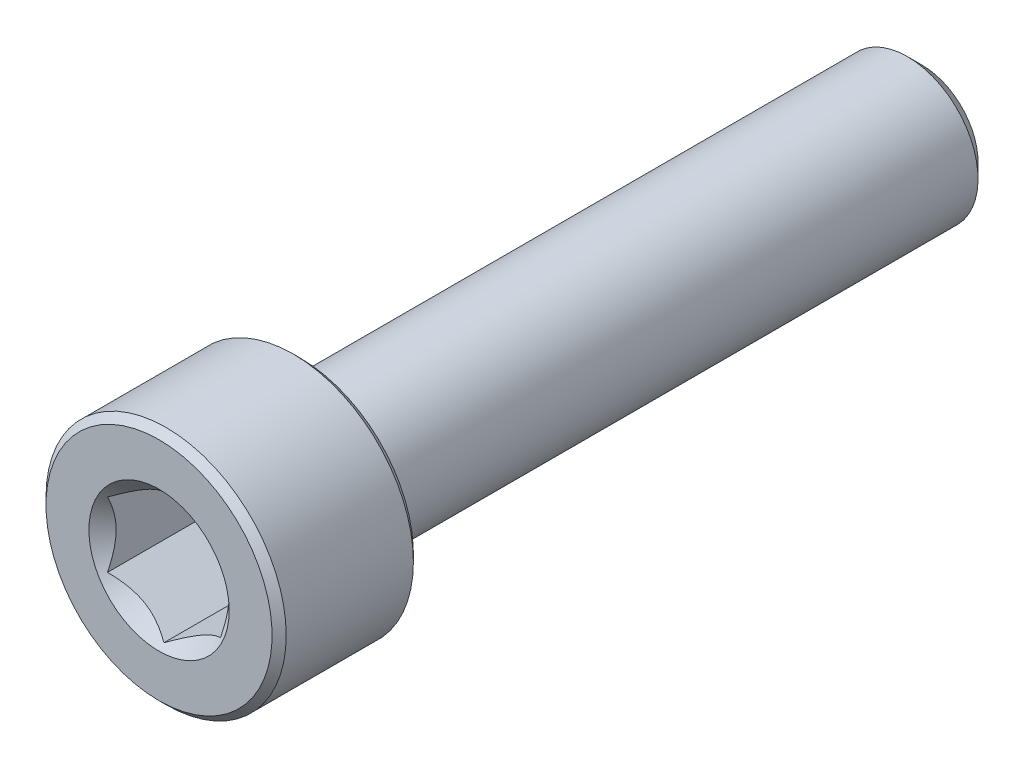
ISO-10303-21;
HEADER;
FILE_DESCRIPTION(('STEP AP214'),'2;1');
FILE_NAME('part.step','',(''),(''),'','','');
FILE_SCHEMA(('AUTOMOTIVE_DESIGN { 1 0 10303 214 1 1 1 1 }'));
ENDSEC;
DATA;
#1=APPLICATION_CONTEXT('core data for automotive mechanical design processes');
#2=APPLICATION_PROTOCOL_DEFINITION('international standard','automotive_design',2000,#1);
#3=PRODUCT_CONTEXT('',#1,'mechanical');
#4=PRODUCT('Part','Part','',(#3));
#5=PRODUCT_RELATED_PRODUCT_CATEGORY('part','',(#4));
#6=PRODUCT_DEFINITION_FORMATION('','',#4);
#7=PRODUCT_DEFINITION_CONTEXT('part definition',#1,'design');
#8=PRODUCT_DEFINITION('design','',#6,#7);
#9=PRODUCT_DEFINITION_SHAPE('','',#8);
#10=(LENGTH_UNIT() NAMED_UNIT(*) SI_UNIT(.MILLI.,.METRE.));
#11=(NAMED_UNIT(*) PLANE_ANGLE_UNIT() SI_UNIT($,.RADIAN.));
#12=(NAMED_UNIT(*) SI_UNIT($,.STERADIAN.) SOLID_ANGLE_UNIT());
#13=UNCERTAINTY_MEASURE_WITH_UNIT(LENGTH_MEASURE(1.E-05),#10,'distance_accuracy_value','');
#14=(GEOMETRIC_REPRESENTATION_CONTEXT(3) GLOBAL_UNCERTAINTY_ASSIGNED_CONTEXT((#13)) GLOBAL_UNIT_ASSIGNED_CONTEXT((#10,
#11,#12)) REPRESENTATION_CONTEXT('',''));
#15=CARTESIAN_POINT('',(0.,0.,0.));
#16=DIRECTION('',(0.,0.,1.));
#17=DIRECTION('',(1.,0.,0.));
#18=AXIS2_PLACEMENT_3D('',#15,#16,#17);
#19=CARTESIAN_POINT('',(0.,1.98038475772934,-13.5));
#20=DIRECTION('',(0.,0.,-1.));
#21=DIRECTION('',(0.,1.,0.));
#22=AXIS2_PLACEMENT_3D('',#19,#20,#21);
#23=PLANE('',#22);
#24=CARTESIAN_POINT('',(0.,0.,-13.5));
#25=DIRECTION('',(0.,0.,-1.));
#26=DIRECTION('',(0.,1.,0.));
#27=AXIS2_PLACEMENT_3D('',#24,#25,#26);
#28=CIRCLE('',#27,1.98038475772934);
#29=CARTESIAN_POINT('',(0.,1.98038475772934,-13.5));
#30=VERTEX_POINT('',#29);
#31=EDGE_CURVE('E48',#30,#30,#28,.T.);
#32=ORIENTED_EDGE('',*,*,#31,.T.);
#33=EDGE_LOOP('',(#32));
#34=FACE_BOUND('',#33,.T.);
#35=ADVANCED_FACE('F35',(#34),#23,.T.);
#36=CARTESIAN_POINT('',(0.,0.,-13.5));
#37=DIRECTION('',(0.,0.,1.));
#38=DIRECTION('',(0.,-1.,0.));
#39=AXIS2_PLACEMENT_3D('',#36,#37,#38);
#40=CONICAL_SURFACE('',#39,1.98038475772934,0.785398163397443);
#41=CARTESIAN_POINT('',(0.,0.,-12.9803847577293));
#42=DIRECTION('',(0.,0.,-1.));
#43=DIRECTION('',(0.,1.,0.));
#44=AXIS2_PLACEMENT_3D('',#41,#42,#43);
#45=CIRCLE('',#44,2.5);
#46=CARTESIAN_POINT('',(0.,2.5,-12.9803847577293));
#47=VERTEX_POINT('',#46);
#48=EDGE_CURVE('E151',#47,#47,#45,.T.);
#49=ORIENTED_EDGE('',*,*,#48,.T.);
#50=EDGE_LOOP('',(#49));
#51=FACE_BOUND('',#50,.T.);
#52=ORIENTED_EDGE('',*,*,#31,.F.);
#53=EDGE_LOOP('',(#52));
#54=FACE_BOUND('',#53,.T.);
#55=ADVANCED_FACE('F157',(#51,#54),#40,.T.);
#56=CARTESIAN_POINT('',(0.,0.,-13.5));
#57=DIRECTION('',(0.,0.,-1.));
#58=DIRECTION('',(0.,1.,0.));
#59=AXIS2_PLACEMENT_3D('',#56,#57,#58);
#60=CYLINDRICAL_SURFACE('',#59,2.5);
#61=CARTESIAN_POINT('',(0.,0.,8.25));
#62=DIRECTION('',(0.,0.,-1.));
#63=DIRECTION('',(0.,1.,0.));
#64=AXIS2_PLACEMENT_3D('',#61,#62,#63);
#65=CIRCLE('',#64,2.5);
#66=CARTESIAN_POINT('',(0.,2.5,8.25));
#67=VERTEX_POINT('',#66);
#68=EDGE_CURVE('E148',#67,#67,#65,.T.);
#69=ORIENTED_EDGE('',*,*,#68,.T.);
#70=EDGE_LOOP('',(#69));
#71=FACE_BOUND('',#70,.T.);
#72=ORIENTED_EDGE('',*,*,#48,.F.);
#73=EDGE_LOOP('',(#72));
#74=FACE_BOUND('',#73,.T.);
#75=ADVANCED_FACE('F159',(#71,#74),#60,.T.);
#76=CARTESIAN_POINT('',(0.,0.,8.25));
#77=DIRECTION('',(0.,0.,-1.));
#78=DIRECTION('',(0.,1.,0.));
#79=AXIS2_PLACEMENT_3D('',#76,#77,#78);
#80=TOROIDAL_SURFACE('',#79,2.75,0.25);
#81=CARTESIAN_POINT('',(0.,0.,8.5));
#82=DIRECTION('',(0.,0.,-1.));
#83=DIRECTION('',(0.,1.,0.));
#84=AXIS2_PLACEMENT_3D('',#81,#82,#83);
#85=CIRCLE('',#84,2.75);
#86=CARTESIAN_POINT('',(0.,2.75,8.5));
#87=VERTEX_POINT('',#86);
#88=EDGE_CURVE('E145',#87,#87,#85,.T.);
#89=ORIENTED_EDGE('',*,*,#88,.T.);
#90=EDGE_LOOP('',(#89));
#91=FACE_BOUND('',#90,.T.);
#92=ORIENTED_EDGE('',*,*,#68,.F.);
#93=EDGE_LOOP('',(#92));
#94=FACE_BOUND('',#93,.T.);
#95=ADVANCED_FACE('F165',(#91,#94),#80,.F.);
#96=CARTESIAN_POINT('',(0.,4.,8.5));
#97=DIRECTION('',(0.,0.,-1.));
#98=DIRECTION('',(0.,1.,0.));
#99=AXIS2_PLACEMENT_3D('',#96,#97,#98);
#100=PLANE('',#99);
#101=CARTESIAN_POINT('',(0.,0.,8.5));
#102=DIRECTION('',(0.,0.,-1.));
#103=DIRECTION('',(0.,1.,0.));
#104=AXIS2_PLACEMENT_3D('',#101,#102,#103);
#105=CIRCLE('',#104,4.);
#106=CARTESIAN_POINT('',(0.,4.,8.5));
#107=VERTEX_POINT('',#106);
#108=EDGE_CURVE('E142',#107,#107,#105,.T.);
#109=ORIENTED_EDGE('',*,*,#108,.T.);
#110=EDGE_LOOP('',(#109));
#111=FACE_BOUND('',#110,.T.);
#112=ORIENTED_EDGE('',*,*,#88,.F.);
#113=EDGE_LOOP('',(#112));
#114=FACE_BOUND('',#113,.T.);
#115=ADVANCED_FACE('F171',(#111,#114),#100,.T.);
#116=CARTESIAN_POINT('',(0.,0.,8.5));
#117=DIRECTION('',(0.,0.,1.));
#118=DIRECTION('',(0.,-1.,0.));
#119=AXIS2_PLACEMENT_3D('',#116,#117,#118);
#120=CONICAL_SURFACE('',#119,4.,0.785398163397448);
#121=CARTESIAN_POINT('',(0.,0.,8.75));
#122=DIRECTION('',(0.,0.,-1.));
#123=DIRECTION('',(0.,1.,0.));
#124=AXIS2_PLACEMENT_3D('',#121,#122,#123);
#125=CIRCLE('',#124,4.25);
#126=CARTESIAN_POINT('',(0.,4.25,8.75));
#127=VERTEX_POINT('',#126);
#128=EDGE_CURVE('E139',#127,#127,#125,.T.);
#129=ORIENTED_EDGE('',*,*,#128,.T.);
#130=EDGE_LOOP('',(#129));
#131=FACE_BOUND('',#130,.T.);
#132=ORIENTED_EDGE('',*,*,#108,.F.);
#133=EDGE_LOOP('',(#132));
#134=FACE_BOUND('',#133,.T.);
#135=ADVANCED_FACE('F175',(#131,#134),#120,.T.);
#136=CARTESIAN_POINT('',(0.,0.,-13.5));
#137=DIRECTION('',(0.,0.,-1.));
#138=DIRECTION('',(0.,1.,0.));
#139=AXIS2_PLACEMENT_3D('',#136,#137,#138);
#140=CYLINDRICAL_SURFACE('',#139,4.25);
#141=CARTESIAN_POINT('',(0.,0.,13.25));
#142=DIRECTION('',(0.,0.,-1.));
#143=DIRECTION('',(0.,1.,0.));
#144=AXIS2_PLACEMENT_3D('',#141,#142,#143);
#145=CIRCLE('',#144,4.25);
#146=CARTESIAN_POINT('',(0.,4.25,13.25));
#147=VERTEX_POINT('',#146);
#148=EDGE_CURVE('E136',#147,#147,#145,.T.);
#149=ORIENTED_EDGE('',*,*,#148,.T.);
#150=EDGE_LOOP('',(#149));
#151=FACE_BOUND('',#150,.T.);
#152=ORIENTED_EDGE('',*,*,#128,.F.);
#153=EDGE_LOOP('',(#152));
#154=FACE_BOUND('',#153,.T.);
#155=ADVANCED_FACE('F179',(#151,#154),#140,.T.);
#156=CARTESIAN_POINT('',(0.,0.,13.25));
#157=DIRECTION('',(0.,0.,-1.));
#158=DIRECTION('',(0.,1.,0.));
#159=AXIS2_PLACEMENT_3D('',#156,#157,#158);
#160=CONICAL_SURFACE('',#159,4.25,0.785398163397448);
#161=CARTESIAN_POINT('',(0.,0.,13.5));
#162=DIRECTION('',(0.,0.,-1.));
#163=DIRECTION('',(0.,1.,0.));
#164=AXIS2_PLACEMENT_3D('',#161,#162,#163);
#165=CIRCLE('',#164,4.);
#166=CARTESIAN_POINT('',(0.,4.,13.5));
#167=VERTEX_POINT('',#166);
#168=EDGE_CURVE('E133',#167,#167,#165,.T.);
#169=ORIENTED_EDGE('',*,*,#168,.T.);
#170=EDGE_LOOP('',(#169));
#171=FACE_BOUND('',#170,.T.);
#172=ORIENTED_EDGE('',*,*,#148,.F.);
#173=EDGE_LOOP('',(#172));
#174=FACE_BOUND('',#173,.T.);
#175=ADVANCED_FACE('F183',(#171,#174),#160,.T.);
#176=CARTESIAN_POINT('',(0.,0.,13.5));
#177=DIRECTION('',(0.,0.,1.));
#178=DIRECTION('',(0.,-1.,0.));
#179=AXIS2_PLACEMENT_3D('',#176,#177,#178);
#180=PLANE('',#179);
#181=CARTESIAN_POINT('',(0.,0.,13.5));
#182=DIRECTION('',(0.,0.,1.));
#183=DIRECTION('',(1.,0.,0.));
#184=AXIS2_PLACEMENT_3D('',#181,#182,#183);
#185=CIRCLE('',#184,2.48260615751539);
#186=CARTESIAN_POINT('',(2.48260615751539,0.,13.5));
#187=VERTEX_POINT('',#186);
#188=EDGE_CURVE('E107',#187,#187,#185,.T.);
#189=ORIENTED_EDGE('',*,*,#188,.F.);
#190=EDGE_LOOP('',(#189));
#191=FACE_BOUND('',#190,.T.);
#192=ORIENTED_EDGE('',*,*,#168,.F.);
#193=EDGE_LOOP('',(#192));
#194=FACE_BOUND('',#193,.T.);
#195=ADVANCED_FACE('F187',(#191,#194),#180,.T.);
#196=CARTESIAN_POINT('',(0.,0.,13.5));
#197=DIRECTION('',(0.,0.,1.));
#198=DIRECTION('',(1.,0.,0.));
#199=AXIS2_PLACEMENT_3D('',#196,#197,#198);
#200=CONICAL_SURFACE('',#199,2.48260615751539,0.78539816339745);
#201=ORIENTED_EDGE('',*,*,#188,.T.);
#202=EDGE_LOOP('',(#201));
#203=FACE_BOUND('',#202,.T.);
#204=CARTESIAN_POINT('',(-0.000199999999998729,-2.30951654681234,13.3269103979568));
#205=CARTESIAN_POINT('',(0.0685530340307069,-2.26982196410711,13.2872480094687));
#206=CARTESIAN_POINT('',(0.138455742135513,-2.22946361676572,13.2499149015273));
#207=CARTESIAN_POINT('',(0.280995244550438,-2.1471683966763,13.1815586043793));
#208=CARTESIAN_POINT('',(0.35364559756536,-2.10522369580642,13.1505734529803));
#209=CARTESIAN_POINT('',(0.500141601053972,-2.02064418875706,13.0974951357873));
#210=CARTESIAN_POINT('',(0.573949935246295,-1.97803092714269,13.0752685464197));
#211=CARTESIAN_POINT('',(0.723191631835265,-1.89186619344273,13.0410237359182));
#212=CARTESIAN_POINT('',(0.798620433918153,-1.84831735425552,13.0289799483872));
#213=CARTESIAN_POINT('',(0.928615500671081,-1.7732646674724,13.0181134311487));
#214=CARTESIAN_POINT('',(0.98301378397011,-1.74185780396625,13.0165046728531));
#215=CARTESIAN_POINT('',(1.0917214555197,-1.67909540053412,13.0192137968418));
#216=CARTESIAN_POINT('',(1.14603080592134,-1.64773988246021,13.0235337570011));
#217=CARTESIAN_POINT('',(1.25413672758934,-1.5853248994842,13.037854486653));
#218=CARTESIAN_POINT('',(1.30793265655479,-1.55426580541469,13.0478616120051));
#219=CARTESIAN_POINT('',(1.41459426230557,-1.49268469862228,13.0730073494928));
#220=CARTESIAN_POINT('',(1.46746001007071,-1.46216264491917,13.0881455682854));
#221=CARTESIAN_POINT('',(1.60287973308985,-1.38397803138049,13.1330894226723));
#222=CARTESIAN_POINT('',(1.68459383484948,-1.33680037273297,13.1662837586689));
#223=CARTESIAN_POINT('',(1.8047470372578,-1.26742988897853,13.2223207424145));
#224=CARTESIAN_POINT('',(1.84434285210918,-1.24456923461531,13.2420096221901));
#225=CARTESIAN_POINT('',(1.92280095888787,-1.19927142554652,13.283182237608));
#226=CARTESIAN_POINT('',(1.96166368359374,-1.17683402097614,13.3046648708944));
#227=CARTESIAN_POINT('',(2.0002,-1.15458506832541,13.3269103979568));
#228=B_SPLINE_CURVE_WITH_KNOTS('',3,(#204,#205,#206,#207,#208,#209,#210,#211,#212,#213,#214,
#215,#216,#217,#218,#219,#220,#221,#222,#223,#224,#225,#226,#227),.UNSPECIFIED.,.F.,.F.,(4,2,2,
2,2,2,2,2,2,2,2,4),(0.,0.266420613771064,0.534393751523388,0.798110374376914,1.06116288956936,
1.24939906803722,1.43770123566248,1.62621426093932,1.81471283831913,2.11415604834145,
2.2634717071779,2.41269626969771),.UNSPECIFIED.);
#229=CARTESIAN_POINT('',(0.,-2.3094010767585,13.3267949192431));
#230=VERTEX_POINT('',#229);
#231=CARTESIAN_POINT('',(2.,-1.15470053837925,13.3267949192431));
#232=VERTEX_POINT('',#231);
#233=EDGE_CURVE('E12',#230,#232,#228,.T.);
#234=ORIENTED_EDGE('',*,*,#233,.F.);
#235=CARTESIAN_POINT('',(-2.0002,-1.15458506832541,13.3269103979568));
#236=CARTESIAN_POINT('',(-1.93144696596929,-1.19427965103064,13.2872480094687));
#237=CARTESIAN_POINT('',(-1.86154425786449,-1.23463799837204,13.2499149015273));
#238=CARTESIAN_POINT('',(-1.71900475544956,-1.31693321846145,13.1815586043793));
#239=CARTESIAN_POINT('',(-1.64635440243464,-1.35887791933134,13.1505734529803));
#240=CARTESIAN_POINT('',(-1.49985839894603,-1.44345742638069,13.0974951357873));
#241=CARTESIAN_POINT('',(-1.42605006475371,-1.48607068799507,13.0752685464197));
#242=CARTESIAN_POINT('',(-1.27680836816474,-1.57223542169503,13.0410237359182));
#243=CARTESIAN_POINT('',(-1.20137956608185,-1.61578426088223,13.0289799483872));
#244=CARTESIAN_POINT('',(-1.07138449932892,-1.69083694766536,13.0181134311487));
#245=CARTESIAN_POINT('',(-1.01698621602989,-1.72224381117151,13.0165046728531));
#246=CARTESIAN_POINT('',(-0.908278544480305,-1.78500621460364,13.0192137968418));
#247=CARTESIAN_POINT('',(-0.85396919407866,-1.81636173267754,13.0235337570011));
#248=CARTESIAN_POINT('',(-0.745863272410661,-1.87877671565355,13.037854486653));
#249=CARTESIAN_POINT('',(-0.692067343445206,-1.90983580972306,13.0478616120051));
#250=CARTESIAN_POINT('',(-0.585405737694425,-1.97141691651548,13.0730073494928));
#251=CARTESIAN_POINT('',(-0.532539989929286,-2.00193897021859,13.0881455682854));
#252=CARTESIAN_POINT('',(-0.397120266910154,-2.08012358375727,13.1330894226723));
#253=CARTESIAN_POINT('',(-0.31540616515052,-2.12730124240478,13.1662837586689));
#254=CARTESIAN_POINT('',(-0.195252962742196,-2.19667172615922,13.2223207424145));
#255=CARTESIAN_POINT('',(-0.155657147890821,-2.21953238052245,13.2420096221901));
#256=CARTESIAN_POINT('',(-0.0771990411121259,-2.26483018959124,13.283182237608));
#257=CARTESIAN_POINT('',(-0.0383363164062579,-2.28726759416161,13.3046648708944));
#258=CARTESIAN_POINT('',(0.00020000000000141,-2.30951654681234,13.3269103979568));
#259=B_SPLINE_CURVE_WITH_KNOTS('',3,(#235,#236,#237,#238,#239,#240,#241,#242,#243,#244,#245,
#246,#247,#248,#249,#250,#251,#252,#253,#254,#255,#256,#257,#258),.UNSPECIFIED.,.F.,.F.,(4,2,2,
2,2,2,2,2,2,2,2,4),(0.,0.266420613771064,0.53439375152339,0.798110374376915,1.06116288956937,
1.24939906803722,1.43770123566248,1.62621426093932,1.81471283831913,2.11415604834145,
2.26347170717791,2.41269626969771),.UNSPECIFIED.);
#260=CARTESIAN_POINT('',(-2.,-1.15470053837925,13.3267949192431));
#261=VERTEX_POINT('',#260);
#262=EDGE_CURVE('E93',#261,#230,#259,.T.);
#263=ORIENTED_EDGE('',*,*,#262,.F.);
#264=CARTESIAN_POINT('',(-2.,-2.42398175579868,14.1599545105457));
#265=CARTESIAN_POINT('',(-2.,-2.36547387630411,14.1148351758713));
#266=CARTESIAN_POINT('',(-2.,-2.30665236661135,14.0701161756265));
#267=CARTESIAN_POINT('',(-2.,-2.18825331969085,13.9816622121418));
#268=CARTESIAN_POINT('',(-2.,-2.12867560822125,13.9379274823771));
#269=CARTESIAN_POINT('',(-2.,-2.00820019262835,13.8513142462896));
#270=CARTESIAN_POINT('',(-2.,-1.94729585350119,13.8084449389484));
#271=CARTESIAN_POINT('',(-2.,-1.82447635639412,13.7241846501668));
#272=CARTESIAN_POINT('',(-2.,-1.76256126823391,13.6827935672392));
#273=CARTESIAN_POINT('',(-2.,-1.63352305153315,13.5992199648467));
#274=CARTESIAN_POINT('',(-2.,-1.56632133333278,13.5571581799355));
#275=CARTESIAN_POINT('',(-2.,-1.43035896394453,13.4756383889365));
#276=CARTESIAN_POINT('',(-2.,-1.3615985170145,13.4361800443101));
#277=CARTESIAN_POINT('',(-2.,-1.22246684398892,13.3606863637627));
#278=CARTESIAN_POINT('',(-2.,-1.15210085009344,13.3246414605251));
#279=CARTESIAN_POINT('',(-2.,-1.00937086384546,13.2567889383446));
#280=CARTESIAN_POINT('',(-2.,-0.937007838648202,13.224979310286));
#281=CARTESIAN_POINT('',(-2.,-0.797532850709096,13.1696918996687));
#282=CARTESIAN_POINT('',(-2.,-0.73062786798457,13.1456972616385));
#283=CARTESIAN_POINT('',(-2.,-0.595101218410189,13.1030621374066));
#284=CARTESIAN_POINT('',(-2.,-0.526479443554564,13.0844219889886));
#285=CARTESIAN_POINT('',(-2.,-0.389131528451131,13.0538205255166));
#286=CARTESIAN_POINT('',(-2.,-0.320433088583213,13.0417369815865));
#287=CARTESIAN_POINT('',(-2.,-0.182167175628636,13.0245029259217));
#288=CARTESIAN_POINT('',(-2.,-0.112599890436882,13.0193509405131));
#289=CARTESIAN_POINT('',(-2.,0.0235742388197043,13.0164261236486));
#290=CARTESIAN_POINT('',(-2.,0.090174262254322,13.0183334186349));
#291=CARTESIAN_POINT('',(-2.,0.222860647279179,13.0286844259992));
#292=CARTESIAN_POINT('',(-2.,0.288946962142557,13.037128726115));
#293=CARTESIAN_POINT('',(-2.,0.421249515605842,13.0602169544548));
#294=CARTESIAN_POINT('',(-2.,0.487446247340619,13.074970869731));
#295=CARTESIAN_POINT('',(-2.,0.618375539180381,13.1098579982816));
#296=CARTESIAN_POINT('',(-2.,0.683108176846779,13.1299909258717));
#297=CARTESIAN_POINT('',(-2.,0.881750195572363,13.199485149858));
#298=CARTESIAN_POINT('',(-2.,1.01295821830486,13.2565400033525));
#299=CARTESIAN_POINT('',(-2.,1.26925973679032,13.3835183967961));
#300=CARTESIAN_POINT('',(-2.,1.39432972284545,13.4534871660011));
#301=CARTESIAN_POINT('',(-2.,1.57512870977373,13.5627644548654));
#302=CARTESIAN_POINT('',(-2.,1.63281357796872,13.5989012241787));
#303=CARTESIAN_POINT('',(-2.,1.74719269140407,13.6727216099303));
#304=CARTESIAN_POINT('',(-2.,1.80388686201493,13.7104053421917));
#305=CARTESIAN_POINT('',(-2.,1.91595826038669,13.7867305219709));
#306=CARTESIAN_POINT('',(-2.,1.97134240267412,13.8253618677048));
#307=CARTESIAN_POINT('',(-2.,2.08135060816028,13.9036615543687));
#308=CARTESIAN_POINT('',(-2.,2.13597487670731,13.9433296064566));
#309=CARTESIAN_POINT('',(-2.,2.19028039622782,13.9834228737147));
#310=B_SPLINE_CURVE_WITH_KNOTS('',3,(#264,#265,#266,#267,#268,#269,#270,#271,#272,#273,#274,
#275,#276,#277,#278,#279,#280,#281,#282,#283,#284,#285,#286,#287,#288,#289,#290,#291,#292,#293,
#294,#295,#296,#297,#298,#299,#300,#301,#302,#303,#304,#305,#306,#307,#308,#309),.UNSPECIFIED.,
.F.,.F.,(4,2,2,2,2,2,2,2,2,2,2,2,2,2,2,2,2,2,2,2,2,2,4),(0.,0.22165766710034,0.443367370127324,
0.666786125723388,0.890189512941441,1.12798201434515,1.36574353320624,1.60281759521649,
1.83977879106023,2.05282811904838,2.26589088413717,2.47483185958037,2.68372840641278,
2.88327763021218,3.08284479743513,3.28604242448891,3.48922926167214,3.91721633282416,
4.34673183999753,4.55091998635569,4.75512344852471,4.95768958131487,5.1601998654356),.UNSPECIFIED.);
#311=CARTESIAN_POINT('',(-2.,1.15470053837925,13.3267949192431));
#312=VERTEX_POINT('',#311);
#313=EDGE_CURVE('E106',#312,#261,#310,.F.);
#314=ORIENTED_EDGE('',*,*,#313,.F.);
#315=CARTESIAN_POINT('',(0.000199999999999905,2.30951654681234,13.3269103979568));
#316=CARTESIAN_POINT('',(-0.068553034030706,2.26982196410711,13.2872480094687));
#317=CARTESIAN_POINT('',(-0.138455742135512,2.22946361676572,13.2499149015273));
#318=CARTESIAN_POINT('',(-0.280995244550437,2.1471683966763,13.1815586043793));
#319=CARTESIAN_POINT('',(-0.353645597565359,2.10522369580642,13.1505734529803));
#320=CARTESIAN_POINT('',(-0.500141601053972,2.02064418875706,13.0974951357873));
#321=CARTESIAN_POINT('',(-0.573949935246295,1.97803092714269,13.0752685464197));
#322=CARTESIAN_POINT('',(-0.723191631835265,1.89186619344273,13.0410237359182));
#323=CARTESIAN_POINT('',(-0.798620433918153,1.84831735425552,13.0289799483872));
#324=CARTESIAN_POINT('',(-0.92861550067108,1.7732646674724,13.0181134311487));
#325=CARTESIAN_POINT('',(-0.98301378397011,1.74185780396625,13.0165046728531));
#326=CARTESIAN_POINT('',(-1.09172145551969,1.67909540053412,13.0192137968418));
#327=CARTESIAN_POINT('',(-1.14603080592134,1.64773988246021,13.0235337570011));
#328=CARTESIAN_POINT('',(-1.25413672758934,1.5853248994842,13.037854486653));
#329=CARTESIAN_POINT('',(-1.30793265655479,1.55426580541469,13.0478616120051));
#330=CARTESIAN_POINT('',(-1.41459426230557,1.49268469862228,13.0730073494928));
#331=CARTESIAN_POINT('',(-1.46746001007071,1.46216264491916,13.0881455682854));
#332=CARTESIAN_POINT('',(-1.60287973308984,1.38397803138048,13.1330894226723));
#333=CARTESIAN_POINT('',(-1.68459383484948,1.33680037273297,13.1662837586689));
#334=CARTESIAN_POINT('',(-1.8047470372578,1.26742988897853,13.2223207424145));
#335=CARTESIAN_POINT('',(-1.84434285210918,1.24456923461531,13.2420096221901));
#336=CARTESIAN_POINT('',(-1.92280095888787,1.19927142554652,13.283182237608));
#337=CARTESIAN_POINT('',(-1.96166368359374,1.17683402097614,13.3046648708944));
#338=CARTESIAN_POINT('',(-2.0002,1.15458506832541,13.3269103979568));
#339=B_SPLINE_CURVE_WITH_KNOTS('',3,(#315,#316,#317,#318,#319,#320,#321,#322,#323,#324,#325,
#326,#327,#328,#329,#330,#331,#332,#333,#334,#335,#336,#337,#338),.UNSPECIFIED.,.F.,.F.,(4,2,2,
2,2,2,2,2,2,2,2,4),(0.,0.266420613771063,0.534393751523389,0.798110374376915,1.06116288956937,
1.24939906803722,1.43770123566248,1.62621426093932,1.81471283831913,2.11415604834145,
2.2634717071779,2.41269626969771),.UNSPECIFIED.);
#340=CARTESIAN_POINT('',(0.,2.3094010767585,13.3267949192431));
#341=VERTEX_POINT('',#340);
#342=EDGE_CURVE('E237',#341,#312,#339,.T.);
#343=ORIENTED_EDGE('',*,*,#342,.F.);
#344=CARTESIAN_POINT('',(2.0002,1.15458506832541,13.3269103979568));
#345=CARTESIAN_POINT('',(1.93144696596929,1.19427965103064,13.2872480094687));
#346=CARTESIAN_POINT('',(1.86154425786449,1.23463799837204,13.2499149015273));
#347=CARTESIAN_POINT('',(1.71900475544956,1.31693321846145,13.1815586043793));
#348=CARTESIAN_POINT('',(1.64635440243464,1.35887791933134,13.1505734529803));
#349=CARTESIAN_POINT('',(1.49985839894603,1.44345742638069,13.0974951357873));
#350=CARTESIAN_POINT('',(1.42605006475371,1.48607068799507,13.0752685464197));
#351=CARTESIAN_POINT('',(1.27680836816474,1.57223542169503,13.0410237359182));
#352=CARTESIAN_POINT('',(1.20137956608185,1.61578426088223,13.0289799483872));
#353=CARTESIAN_POINT('',(1.07138449932892,1.69083694766536,13.0181134311487));
#354=CARTESIAN_POINT('',(1.01698621602989,1.72224381117151,13.0165046728531));
#355=CARTESIAN_POINT('',(0.908278544480305,1.78500621460364,13.0192137968418));
#356=CARTESIAN_POINT('',(0.85396919407866,1.81636173267754,13.0235337570011));
#357=CARTESIAN_POINT('',(0.745863272410661,1.87877671565355,13.037854486653));
#358=CARTESIAN_POINT('',(0.692067343445207,1.90983580972306,13.0478616120051));
#359=CARTESIAN_POINT('',(0.585405737694425,1.97141691651547,13.0730073494928));
#360=CARTESIAN_POINT('',(0.532539989929286,2.00193897021859,13.0881455682854));
#361=CARTESIAN_POINT('',(0.397120266910155,2.08012358375727,13.1330894226723));
#362=CARTESIAN_POINT('',(0.315406165150521,2.12730124240478,13.1662837586689));
#363=CARTESIAN_POINT('',(0.195252962742197,2.19667172615922,13.2223207424145));
#364=CARTESIAN_POINT('',(0.155657147890823,2.21953238052245,13.2420096221901));
#365=CARTESIAN_POINT('',(0.0771990411121273,2.26483018959124,13.283182237608));
#366=CARTESIAN_POINT('',(0.0383363164062591,2.28726759416161,13.3046648708944));
#367=CARTESIAN_POINT('',(-0.000200000000000571,2.30951654681234,13.3269103979568));
#368=B_SPLINE_CURVE_WITH_KNOTS('',3,(#344,#345,#346,#347,#348,#349,#350,#351,#352,#353,#354,
#355,#356,#357,#358,#359,#360,#361,#362,#363,#364,#365,#366,#367),.UNSPECIFIED.,.F.,.F.,(4,2,2,
2,2,2,2,2,2,2,2,4),(0.,0.266420613771064,0.534393751523388,0.798110374376915,1.06116288956936,
1.24939906803722,1.43770123566248,1.62621426093932,1.81471283831913,2.11415604834145,
2.26347170717791,2.41269626969771),.UNSPECIFIED.);
#369=CARTESIAN_POINT('',(2.,1.15470053837925,13.3267949192431));
#370=VERTEX_POINT('',#369);
#371=EDGE_CURVE('E210',#370,#341,#368,.T.);
#372=ORIENTED_EDGE('',*,*,#371,.F.);
#373=CARTESIAN_POINT('',(2.,-2.42398175579868,14.1599545105457));
#374=CARTESIAN_POINT('',(2.,-2.3654738763041,14.1148351758713));
#375=CARTESIAN_POINT('',(2.,-2.30665236661135,14.0701161756265));
#376=CARTESIAN_POINT('',(2.,-2.18825331969085,13.9816622121418));
#377=CARTESIAN_POINT('',(2.,-2.12867560822125,13.9379274823771));
#378=CARTESIAN_POINT('',(2.,-2.00820019262835,13.8513142462896));
#379=CARTESIAN_POINT('',(2.,-1.94729585350119,13.8084449389484));
#380=CARTESIAN_POINT('',(2.,-1.82447635639412,13.7241846501668));
#381=CARTESIAN_POINT('',(2.,-1.76256126823391,13.6827935672392));
#382=CARTESIAN_POINT('',(2.,-1.63352305153315,13.5992199648467));
#383=CARTESIAN_POINT('',(2.,-1.56632133333278,13.5571581799355));
#384=CARTESIAN_POINT('',(2.,-1.43035896394453,13.4756383889365));
#385=CARTESIAN_POINT('',(2.,-1.3615985170145,13.4361800443101));
#386=CARTESIAN_POINT('',(2.,-1.22246684398892,13.3606863637627));
#387=CARTESIAN_POINT('',(2.,-1.15210085009344,13.3246414605251));
#388=CARTESIAN_POINT('',(2.,-1.00937086384545,13.2567889383446));
#389=CARTESIAN_POINT('',(2.,-0.937007838648201,13.224979310286));
#390=CARTESIAN_POINT('',(2.,-0.797532850709095,13.1696918996687));
#391=CARTESIAN_POINT('',(2.,-0.730627867984569,13.1456972616385));
#392=CARTESIAN_POINT('',(2.,-0.595101218410188,13.1030621374066));
#393=CARTESIAN_POINT('',(2.,-0.526479443554564,13.0844219889886));
#394=CARTESIAN_POINT('',(2.,-0.389131528451131,13.0538205255166));
#395=CARTESIAN_POINT('',(2.,-0.320433088583214,13.0417369815865));
#396=CARTESIAN_POINT('',(2.,-0.182167175628637,13.0245029259217));
#397=CARTESIAN_POINT('',(2.,-0.112599890436883,13.0193509405131));
#398=CARTESIAN_POINT('',(2.,0.0235742388197037,13.0164261236486));
#399=CARTESIAN_POINT('',(2.,0.0901742622543216,13.0183334186349));
#400=CARTESIAN_POINT('',(2.,0.222860647279179,13.0286844259992));
#401=CARTESIAN_POINT('',(2.,0.288946962142556,13.037128726115));
#402=CARTESIAN_POINT('',(2.,0.421249515605842,13.0602169544548));
#403=CARTESIAN_POINT('',(2.,0.487446247340619,13.074970869731));
#404=CARTESIAN_POINT('',(2.,0.61837553918038,13.1098579982816));
#405=CARTESIAN_POINT('',(2.,0.683108176846778,13.1299909258717));
#406=CARTESIAN_POINT('',(2.,0.881750195572362,13.199485149858));
#407=CARTESIAN_POINT('',(2.,1.01295821830486,13.2565400033525));
#408=CARTESIAN_POINT('',(2.,1.26925973679032,13.3835183967961));
#409=CARTESIAN_POINT('',(2.,1.39432972284545,13.4534871660011));
#410=CARTESIAN_POINT('',(2.,1.57512870977373,13.5627644548654));
#411=CARTESIAN_POINT('',(2.,1.63281357796872,13.5989012241787));
#412=CARTESIAN_POINT('',(2.,1.74719269140407,13.6727216099303));
#413=CARTESIAN_POINT('',(2.,1.80388686201493,13.7104053421917));
#414=CARTESIAN_POINT('',(2.,1.91595826038669,13.7867305219709));
#415=CARTESIAN_POINT('',(2.,1.97134240267412,13.8253618677048));
#416=CARTESIAN_POINT('',(2.,2.08135060816028,13.9036615543687));
#417=CARTESIAN_POINT('',(2.,2.13597487670731,13.9433296064566));
#418=CARTESIAN_POINT('',(2.,2.19028039622781,13.9834228737147));
#419=B_SPLINE_CURVE_WITH_KNOTS('',3,(#373,#374,#375,#376,#377,#378,#379,#380,#381,#382,#383,
#384,#385,#386,#387,#388,#389,#390,#391,#392,#393,#394,#395,#396,#397,#398,#399,#400,#401,#402,
#403,#404,#405,#406,#407,#408,#409,#410,#411,#412,#413,#414,#415,#416,#417,#418),.UNSPECIFIED.,
.F.,.F.,(4,2,2,2,2,2,2,2,2,2,2,2,2,2,2,2,2,2,2,2,2,2,4),(0.,0.221657667100339,0.443367370127324,
0.666786125723386,0.89018951294144,1.12798201434515,1.36574353320624,1.60281759521649,
1.83977879106023,2.05282811904838,2.26589088413717,2.47483185958037,2.68372840641278,
2.88327763021218,3.08284479743513,3.28604242448891,3.48922926167214,3.91721633282416,
4.34673183999753,4.55091998635569,4.75512344852471,4.95768958131487,5.1601998654356),.UNSPECIFIED.);
#420=EDGE_CURVE('E55',#232,#370,#419,.T.);
#421=ORIENTED_EDGE('',*,*,#420,.F.);
#422=EDGE_LOOP('',(#234,#263,#314,#343,#372,#421));
#423=FACE_BOUND('',#422,.T.);
#424=ADVANCED_FACE('F92',(#203,#423),#200,.F.);
#425=CARTESIAN_POINT('',(0.,4.,9.5));
#426=DIRECTION('',(0.,0.,-1.));
#427=DIRECTION('',(0.,1.,0.));
#428=AXIS2_PLACEMENT_3D('',#425,#426,#427);
#429=PLANE('',#428);
#430=DIRECTION('',(0.866025403784438,0.5,0.));
#431=VECTOR('',#430,1.);
#432=CARTESIAN_POINT('',(0.,-2.3094010767585,9.5));
#433=LINE('',#432,#431);
#434=CARTESIAN_POINT('',(0.,-2.3094010767585,9.5));
#435=VERTEX_POINT('',#434);
#436=CARTESIAN_POINT('',(2.,-1.15470053837925,9.5));
#437=VERTEX_POINT('',#436);
#438=EDGE_CURVE('E110',#435,#437,#433,.T.);
#439=ORIENTED_EDGE('',*,*,#438,.T.);
#440=DIRECTION('',(0.,1.,0.));
#441=VECTOR('',#440,1.);
#442=CARTESIAN_POINT('',(2.,-1.15470053837925,9.5));
#443=LINE('',#442,#441);
#444=CARTESIAN_POINT('',(2.,1.15470053837925,9.5));
#445=VERTEX_POINT('',#444);
#446=EDGE_CURVE('E62',#437,#445,#443,.T.);
#447=ORIENTED_EDGE('',*,*,#446,.T.);
#448=DIRECTION('',(-0.866025403784439,0.5,0.));
#449=VECTOR('',#448,1.);
#450=CARTESIAN_POINT('',(2.,1.15470053837925,9.5));
#451=LINE('',#450,#449);
#452=CARTESIAN_POINT('',(0.,2.3094010767585,9.5));
#453=VERTEX_POINT('',#452);
#454=EDGE_CURVE('E118',#445,#453,#451,.T.);
#455=ORIENTED_EDGE('',*,*,#454,.T.);
#456=DIRECTION('',(-0.866025403784439,-0.5,0.));
#457=VECTOR('',#456,1.);
#458=CARTESIAN_POINT('',(0.,2.3094010767585,9.5));
#459=LINE('',#458,#457);
#460=CARTESIAN_POINT('',(-2.,1.15470053837925,9.5));
#461=VERTEX_POINT('',#460);
#462=EDGE_CURVE('E125',#453,#461,#459,.T.);
#463=ORIENTED_EDGE('',*,*,#462,.T.);
#464=DIRECTION('',(0.,-1.,0.));
#465=VECTOR('',#464,1.);
#466=CARTESIAN_POINT('',(-2.,1.15470053837925,9.5));
#467=LINE('',#466,#465);
#468=CARTESIAN_POINT('',(-2.,-1.15470053837925,9.5));
#469=VERTEX_POINT('',#468);
#470=EDGE_CURVE('E121',#461,#469,#467,.T.);
#471=ORIENTED_EDGE('',*,*,#470,.T.);
#472=DIRECTION('',(0.866025403784439,-0.5,0.));
#473=VECTOR('',#472,1.);
#474=CARTESIAN_POINT('',(-2.,-1.15470053837925,9.5));
#475=LINE('',#474,#473);
#476=EDGE_CURVE('E111',#469,#435,#475,.T.);
#477=ORIENTED_EDGE('',*,*,#476,.T.);
#478=EDGE_LOOP('',(#439,#447,#455,#463,#471,#477));
#479=FACE_BOUND('',#478,.T.);
#480=ADVANCED_FACE('F192',(#479),#429,.F.);
#481=CARTESIAN_POINT('',(0.,-2.3094010767585,2.38989907339222));
#482=DIRECTION('',(0.5,-0.866025403784438,0.));
#483=DIRECTION('',(0.866025403784438,0.5,0.));
#484=AXIS2_PLACEMENT_3D('',#481,#482,#483);
#485=PLANE('',#484);
#486=DIRECTION('',(0.,0.,1.));
#487=VECTOR('',#486,1.);
#488=CARTESIAN_POINT('',(0.,-2.3094010767585,2.38989907339222));
#489=LINE('',#488,#487);
#490=EDGE_CURVE('E102',#435,#230,#489,.T.);
#491=ORIENTED_EDGE('',*,*,#490,.T.);
#492=ORIENTED_EDGE('',*,*,#233,.T.);
#493=DIRECTION('',(0.,0.,1.));
#494=VECTOR('',#493,1.);
#495=CARTESIAN_POINT('',(2.,-1.15470053837925,2.38989907339222));
#496=LINE('',#495,#494);
#497=EDGE_CURVE('E113',#437,#232,#496,.T.);
#498=ORIENTED_EDGE('',*,*,#497,.F.);
#499=ORIENTED_EDGE('',*,*,#438,.F.);
#500=EDGE_LOOP('',(#491,#492,#498,#499));
#501=FACE_BOUND('',#500,.T.);
#502=ADVANCED_FACE('F109',(#501),#485,.F.);
#503=CARTESIAN_POINT('',(-2.,-1.15470053837925,2.38989907339222));
#504=DIRECTION('',(-0.5,-0.866025403784439,0.));
#505=DIRECTION('',(0.866025403784439,-0.5,0.));
#506=AXIS2_PLACEMENT_3D('',#503,#504,#505);
#507=PLANE('',#506);
#508=DIRECTION('',(0.,0.,1.));
#509=VECTOR('',#508,1.);
#510=CARTESIAN_POINT('',(-2.,-1.15470053837925,2.38989907339222));
#511=LINE('',#510,#509);
#512=EDGE_CURVE('E105',#469,#261,#511,.T.);
#513=ORIENTED_EDGE('',*,*,#512,.T.);
#514=ORIENTED_EDGE('',*,*,#262,.T.);
#515=ORIENTED_EDGE('',*,*,#490,.F.);
#516=ORIENTED_EDGE('',*,*,#476,.F.);
#517=EDGE_LOOP('',(#513,#514,#515,#516));
#518=FACE_BOUND('',#517,.T.);
#519=ADVANCED_FACE('F101',(#518),#507,.F.);
#520=CARTESIAN_POINT('',(-2.,1.15470053837925,2.38989907339222));
#521=DIRECTION('',(-1.,0.,0.));
#522=DIRECTION('',(0.,0.,1.));
#523=AXIS2_PLACEMENT_3D('',#520,#521,#522);
#524=PLANE('',#523);
#525=DIRECTION('',(0.,0.,1.));
#526=VECTOR('',#525,1.);
#527=CARTESIAN_POINT('',(-2.,1.15470053837925,2.38989907339222));
#528=LINE('',#527,#526);
#529=EDGE_CURVE('E122',#461,#312,#528,.T.);
#530=ORIENTED_EDGE('',*,*,#529,.T.);
#531=ORIENTED_EDGE('',*,*,#313,.T.);
#532=ORIENTED_EDGE('',*,*,#512,.F.);
#533=ORIENTED_EDGE('',*,*,#470,.F.);
#534=EDGE_LOOP('',(#530,#531,#532,#533));
#535=FACE_BOUND('',#534,.T.);
#536=ADVANCED_FACE('F246',(#535),#524,.F.);
#537=CARTESIAN_POINT('',(0.,2.3094010767585,2.38989907339222));
#538=DIRECTION('',(-0.5,0.866025403784438,0.));
#539=DIRECTION('',(-0.866025403784439,-0.5,0.));
#540=AXIS2_PLACEMENT_3D('',#537,#538,#539);
#541=PLANE('',#540);
#542=DIRECTION('',(0.,0.,1.));
#543=VECTOR('',#542,1.);
#544=CARTESIAN_POINT('',(0.,2.3094010767585,2.38989907339222));
#545=LINE('',#544,#543);
#546=EDGE_CURVE('E126',#453,#341,#545,.T.);
#547=ORIENTED_EDGE('',*,*,#546,.T.);
#548=ORIENTED_EDGE('',*,*,#342,.T.);
#549=ORIENTED_EDGE('',*,*,#529,.F.);
#550=ORIENTED_EDGE('',*,*,#462,.F.);
#551=EDGE_LOOP('',(#547,#548,#549,#550));
#552=FACE_BOUND('',#551,.T.);
#553=ADVANCED_FACE('F243',(#552),#541,.F.);
#554=CARTESIAN_POINT('',(2.,1.15470053837925,2.38989907339222));
#555=DIRECTION('',(0.5,0.866025403784439,0.));
#556=DIRECTION('',(-0.866025403784439,0.5,0.));
#557=AXIS2_PLACEMENT_3D('',#554,#555,#556);
#558=PLANE('',#557);
#559=DIRECTION('',(0.,0.,1.));
#560=VECTOR('',#559,1.);
#561=CARTESIAN_POINT('',(2.,1.15470053837925,2.38989907339222));
#562=LINE('',#561,#560);
#563=EDGE_CURVE('E129',#445,#370,#562,.T.);
#564=ORIENTED_EDGE('',*,*,#563,.T.);
#565=ORIENTED_EDGE('',*,*,#371,.T.);
#566=ORIENTED_EDGE('',*,*,#546,.F.);
#567=ORIENTED_EDGE('',*,*,#454,.F.);
#568=EDGE_LOOP('',(#564,#565,#566,#567));
#569=FACE_BOUND('',#568,.T.);
#570=ADVANCED_FACE('F200',(#569),#558,.F.);
#571=CARTESIAN_POINT('',(2.,-1.15470053837925,2.38989907339222));
#572=DIRECTION('',(1.,0.,0.));
#573=DIRECTION('',(0.,0.,-1.));
#574=AXIS2_PLACEMENT_3D('',#571,#572,#573);
#575=PLANE('',#574);
#576=ORIENTED_EDGE('',*,*,#497,.T.);
#577=ORIENTED_EDGE('',*,*,#420,.T.);
#578=ORIENTED_EDGE('',*,*,#563,.F.);
#579=ORIENTED_EDGE('',*,*,#446,.F.);
#580=EDGE_LOOP('',(#576,#577,#578,#579));
#581=FACE_BOUND('',#580,.T.);
#582=ADVANCED_FACE('F196',(#581),#575,.F.);
#583=CLOSED_SHELL('',(#35,#55,#75,#95,#115,#135,#155,#175,#195,#424,#480,#502,#519,#536,#553,
#570,#582));
#584=MANIFOLD_SOLID_BREP('B2',#583);
#585=ADVANCED_BREP_SHAPE_REPRESENTATION('',(#18,#584),#14);
#586=SHAPE_DEFINITION_REPRESENTATION(#9,#585);
ENDSEC;
END-ISO-10303-21;
